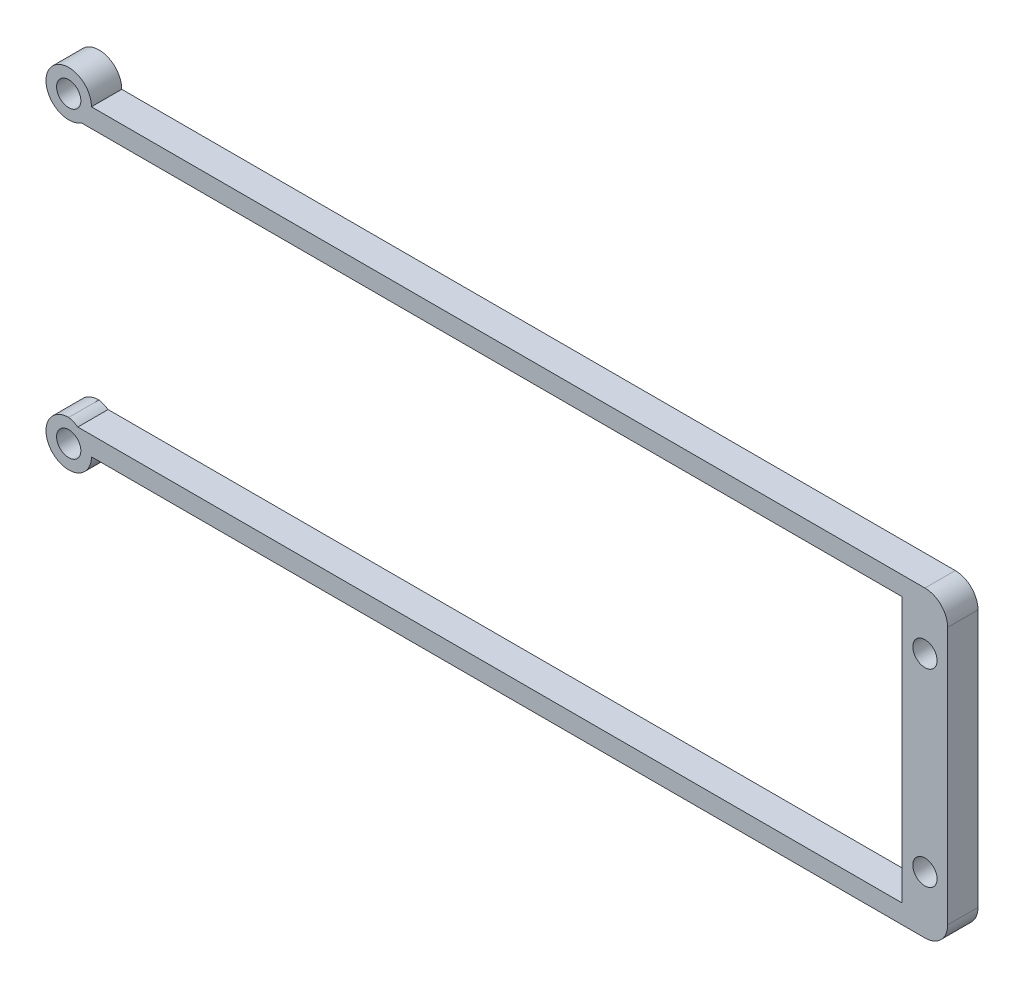
ISO-10303-21;
HEADER;
FILE_DESCRIPTION(('STEP AP214'),'2;1');
FILE_NAME('part.step','',(''),(''),'','','');
FILE_SCHEMA(('AUTOMOTIVE_DESIGN { 1 0 10303 214 1 1 1 1 }'));
ENDSEC;
DATA;
#1=APPLICATION_CONTEXT('core data for automotive mechanical design processes');
#2=APPLICATION_PROTOCOL_DEFINITION('international standard','automotive_design',2000,#1);
#3=PRODUCT_CONTEXT('',#1,'mechanical');
#4=PRODUCT('Part','Part','',(#3));
#5=PRODUCT_RELATED_PRODUCT_CATEGORY('part','',(#4));
#6=PRODUCT_DEFINITION_FORMATION('','',#4);
#7=PRODUCT_DEFINITION_CONTEXT('part definition',#1,'design');
#8=PRODUCT_DEFINITION('design','',#6,#7);
#9=PRODUCT_DEFINITION_SHAPE('','',#8);
#10=(LENGTH_UNIT() NAMED_UNIT(*) SI_UNIT(.MILLI.,.METRE.));
#11=(NAMED_UNIT(*) PLANE_ANGLE_UNIT() SI_UNIT($,.RADIAN.));
#12=(NAMED_UNIT(*) SI_UNIT($,.STERADIAN.) SOLID_ANGLE_UNIT());
#13=UNCERTAINTY_MEASURE_WITH_UNIT(LENGTH_MEASURE(1.E-05),#10,'distance_accuracy_value','');
#14=(GEOMETRIC_REPRESENTATION_CONTEXT(3) GLOBAL_UNCERTAINTY_ASSIGNED_CONTEXT((#13)) GLOBAL_UNIT_ASSIGNED_CONTEXT((#10,
#11,#12)) REPRESENTATION_CONTEXT('',''));
#15=CARTESIAN_POINT('',(0.,0.,0.));
#16=DIRECTION('',(0.,0.,1.));
#17=DIRECTION('',(1.,0.,0.));
#18=AXIS2_PLACEMENT_3D('',#15,#16,#17);
#19=CARTESIAN_POINT('',(-3.,37.,4.));
#20=DIRECTION('',(0.,0.,1.));
#21=DIRECTION('',(1.,0.,0.));
#22=AXIS2_PLACEMENT_3D('',#19,#20,#21);
#23=PLANE('',#22);
#24=DIRECTION('',(-1.,0.,0.));
#25=VECTOR('',#24,1.);
#26=CARTESIAN_POINT('',(0.,-3.,4.));
#27=LINE('',#26,#25);
#28=CARTESIAN_POINT('',(110.,-3.,4.));
#29=VERTEX_POINT('',#28);
#30=CARTESIAN_POINT('',(0.,-3.,4.));
#31=VERTEX_POINT('',#30);
#32=EDGE_CURVE('E143',#29,#31,#27,.T.);
#33=ORIENTED_EDGE('',*,*,#32,.F.);
#34=CARTESIAN_POINT('',(110.,0.,4.));
#35=DIRECTION('',(0.,0.,1.));
#36=DIRECTION('',(1.,0.,0.));
#37=AXIS2_PLACEMENT_3D('',#34,#35,#36);
#38=CIRCLE('',#37,3.);
#39=CARTESIAN_POINT('',(113.,0.,4.));
#40=VERTEX_POINT('',#39);
#41=EDGE_CURVE('E43',#29,#40,#38,.T.);
#42=ORIENTED_EDGE('',*,*,#41,.T.);
#43=DIRECTION('',(0.,1.,0.));
#44=VECTOR('',#43,1.);
#45=CARTESIAN_POINT('',(113.,0.,4.));
#46=LINE('',#45,#44);
#47=CARTESIAN_POINT('',(113.,34.,4.));
#48=VERTEX_POINT('',#47);
#49=EDGE_CURVE('E180',#40,#48,#46,.T.);
#50=ORIENTED_EDGE('',*,*,#49,.T.);
#51=CARTESIAN_POINT('',(110.,34.,4.));
#52=DIRECTION('',(0.,0.,1.));
#53=DIRECTION('',(1.,0.,0.));
#54=AXIS2_PLACEMENT_3D('',#51,#52,#53);
#55=CIRCLE('',#54,3.);
#56=CARTESIAN_POINT('',(110.,37.,4.));
#57=VERTEX_POINT('',#56);
#58=EDGE_CURVE('E50',#48,#57,#55,.T.);
#59=ORIENTED_EDGE('',*,*,#58,.T.);
#60=DIRECTION('',(1.,0.,0.));
#61=VECTOR('',#60,1.);
#62=CARTESIAN_POINT('',(0.,37.,4.));
#63=LINE('',#62,#61);
#64=CARTESIAN_POINT('',(0.,37.,4.));
#65=VERTEX_POINT('',#64);
#66=EDGE_CURVE('E133',#65,#57,#63,.T.);
#67=ORIENTED_EDGE('',*,*,#66,.F.);
#68=CARTESIAN_POINT('',(-3.,37.,4.));
#69=DIRECTION('',(0.,0.,1.));
#70=DIRECTION('',(1.,0.,0.));
#71=AXIS2_PLACEMENT_3D('',#68,#69,#70);
#72=CIRCLE('',#71,3.);
#73=CARTESIAN_POINT('',(-1.3416876048223,34.5,4.));
#74=VERTEX_POINT('',#73);
#75=EDGE_CURVE('E119',#65,#74,#72,.T.);
#76=ORIENTED_EDGE('',*,*,#75,.T.);
#77=DIRECTION('',(-1.,0.,0.));
#78=VECTOR('',#77,1.);
#79=CARTESIAN_POINT('',(52.,34.5,4.));
#80=LINE('',#79,#78);
#81=CARTESIAN_POINT('',(107.,34.5,4.));
#82=VERTEX_POINT('',#81);
#83=EDGE_CURVE('E154',#82,#74,#80,.T.);
#84=ORIENTED_EDGE('',*,*,#83,.F.);
#85=DIRECTION('',(0.,1.,0.));
#86=VECTOR('',#85,1.);
#87=CARTESIAN_POINT('',(107.,0.,4.));
#88=LINE('',#87,#86);
#89=CARTESIAN_POINT('',(107.,-0.5,4.));
#90=VERTEX_POINT('',#89);
#91=EDGE_CURVE('E158',#90,#82,#88,.T.);
#92=ORIENTED_EDGE('',*,*,#91,.F.);
#93=DIRECTION('',(1.,0.,0.));
#94=VECTOR('',#93,1.);
#95=CARTESIAN_POINT('',(52.,-0.5,4.));
#96=LINE('',#95,#94);
#97=CARTESIAN_POINT('',(-1.80104211917182,-0.5,4.));
#98=VERTEX_POINT('',#97);
#99=EDGE_CURVE('E165',#98,#90,#96,.T.);
#100=ORIENTED_EDGE('',*,*,#99,.F.);
#101=CARTESIAN_POINT('',(-3.52783349779163,-2.95320026388477,4.));
#102=DIRECTION('',(0.,0.,-1.));
#103=DIRECTION('',(-1.,0.,0.));
#104=AXIS2_PLACEMENT_3D('',#101,#102,#103);
#105=CIRCLE('',#104,3.);
#106=CARTESIAN_POINT('',(-3.,0.,4.));
#107=VERTEX_POINT('',#106);
#108=EDGE_CURVE('E149',#107,#98,#105,.T.);
#109=ORIENTED_EDGE('',*,*,#108,.F.);
#110=CARTESIAN_POINT('',(-3.,-3.,4.));
#111=DIRECTION('',(0.,0.,1.));
#112=DIRECTION('',(1.,0.,0.));
#113=AXIS2_PLACEMENT_3D('',#110,#111,#112);
#114=CIRCLE('',#113,3.);
#115=EDGE_CURVE('E128',#107,#31,#114,.T.);
#116=ORIENTED_EDGE('',*,*,#115,.T.);
#117=EDGE_LOOP('',(#33,#42,#50,#59,#67,#76,#84,#92,#100,#109,#116));
#118=FACE_BOUND('',#117,.T.);
#119=CARTESIAN_POINT('',(110.,29.5,4.));
#120=DIRECTION('',(0.,0.,1.));
#121=DIRECTION('',(1.,0.,0.));
#122=AXIS2_PLACEMENT_3D('',#119,#120,#121);
#123=CIRCLE('',#122,1.6);
#124=CARTESIAN_POINT('',(111.6,29.5,4.));
#125=VERTEX_POINT('',#124);
#126=EDGE_CURVE('E184',#125,#125,#123,.T.);
#127=ORIENTED_EDGE('',*,*,#126,.F.);
#128=EDGE_LOOP('',(#127));
#129=FACE_BOUND('',#128,.T.);
#130=CARTESIAN_POINT('',(110.,4.54369901210271,4.));
#131=DIRECTION('',(0.,0.,1.));
#132=DIRECTION('',(1.,0.,0.));
#133=AXIS2_PLACEMENT_3D('',#130,#131,#132);
#134=CIRCLE('',#133,1.60000000000001);
#135=CARTESIAN_POINT('',(111.6,4.54369901210271,4.));
#136=VERTEX_POINT('',#135);
#137=EDGE_CURVE('E183',#136,#136,#134,.T.);
#138=ORIENTED_EDGE('',*,*,#137,.F.);
#139=EDGE_LOOP('',(#138));
#140=FACE_BOUND('',#139,.T.);
#141=CARTESIAN_POINT('',(-3.,37.,4.));
#142=DIRECTION('',(0.,0.,1.));
#143=DIRECTION('',(1.,0.,0.));
#144=AXIS2_PLACEMENT_3D('',#141,#142,#143);
#145=CIRCLE('',#144,1.6);
#146=CARTESIAN_POINT('',(-1.4,37.,4.));
#147=VERTEX_POINT('',#146);
#148=EDGE_CURVE('E203',#147,#147,#145,.T.);
#149=ORIENTED_EDGE('',*,*,#148,.F.);
#150=EDGE_LOOP('',(#149));
#151=FACE_BOUND('',#150,.T.);
#152=CARTESIAN_POINT('',(-3.,-3.,4.));
#153=DIRECTION('',(0.,0.,1.));
#154=DIRECTION('',(1.,0.,0.));
#155=AXIS2_PLACEMENT_3D('',#152,#153,#154);
#156=CIRCLE('',#155,1.6);
#157=CARTESIAN_POINT('',(-1.4,-3.,4.));
#158=VERTEX_POINT('',#157);
#159=EDGE_CURVE('E197',#158,#158,#156,.T.);
#160=ORIENTED_EDGE('',*,*,#159,.F.);
#161=EDGE_LOOP('',(#160));
#162=FACE_BOUND('',#161,.T.);
#163=ADVANCED_FACE('F35',(#118,#129,#140,#151,#162),#23,.T.);
#164=CARTESIAN_POINT('',(-3.,37.,0.));
#165=DIRECTION('',(0.,0.,1.));
#166=DIRECTION('',(1.,0.,0.));
#167=AXIS2_PLACEMENT_3D('',#164,#165,#166);
#168=PLANE('',#167);
#169=DIRECTION('',(0.,-1.,0.));
#170=VECTOR('',#169,1.);
#171=CARTESIAN_POINT('',(113.,0.,0.));
#172=LINE('',#171,#170);
#173=CARTESIAN_POINT('',(113.,34.,0.));
#174=VERTEX_POINT('',#173);
#175=CARTESIAN_POINT('',(113.,0.,0.));
#176=VERTEX_POINT('',#175);
#177=EDGE_CURVE('E182',#174,#176,#172,.T.);
#178=ORIENTED_EDGE('',*,*,#177,.T.);
#179=CARTESIAN_POINT('',(110.,0.,0.));
#180=DIRECTION('',(0.,0.,1.));
#181=DIRECTION('',(1.,0.,0.));
#182=AXIS2_PLACEMENT_3D('',#179,#180,#181);
#183=CIRCLE('',#182,3.);
#184=CARTESIAN_POINT('',(110.,-3.,0.));
#185=VERTEX_POINT('',#184);
#186=EDGE_CURVE('E225',#176,#185,#183,.F.);
#187=ORIENTED_EDGE('',*,*,#186,.T.);
#188=DIRECTION('',(-1.,0.,0.));
#189=VECTOR('',#188,1.);
#190=CARTESIAN_POINT('',(-3.,-3.,0.));
#191=LINE('',#190,#189);
#192=CARTESIAN_POINT('',(0.,-3.,0.));
#193=VERTEX_POINT('',#192);
#194=EDGE_CURVE('E137',#185,#193,#191,.T.);
#195=ORIENTED_EDGE('',*,*,#194,.T.);
#196=CARTESIAN_POINT('',(-3.,-3.,0.));
#197=DIRECTION('',(0.,0.,1.));
#198=DIRECTION('',(1.,0.,0.));
#199=AXIS2_PLACEMENT_3D('',#196,#197,#198);
#200=CIRCLE('',#199,3.);
#201=CARTESIAN_POINT('',(-3.,0.,0.));
#202=VERTEX_POINT('',#201);
#203=EDGE_CURVE('E206',#202,#193,#200,.T.);
#204=ORIENTED_EDGE('',*,*,#203,.F.);
#205=CARTESIAN_POINT('',(-3.52783349779163,-2.95320026388477,0.));
#206=DIRECTION('',(0.,0.,-1.));
#207=DIRECTION('',(-1.,0.,0.));
#208=AXIS2_PLACEMENT_3D('',#205,#206,#207);
#209=CIRCLE('',#208,3.);
#210=CARTESIAN_POINT('',(-1.80104211917182,-0.5,0.));
#211=VERTEX_POINT('',#210);
#212=EDGE_CURVE('E161',#202,#211,#209,.T.);
#213=ORIENTED_EDGE('',*,*,#212,.T.);
#214=DIRECTION('',(1.,0.,0.));
#215=VECTOR('',#214,1.);
#216=CARTESIAN_POINT('',(52.,-0.5,0.));
#217=LINE('',#216,#215);
#218=CARTESIAN_POINT('',(107.,-0.5,0.));
#219=VERTEX_POINT('',#218);
#220=EDGE_CURVE('E164',#211,#219,#217,.T.);
#221=ORIENTED_EDGE('',*,*,#220,.T.);
#222=DIRECTION('',(0.,1.,0.));
#223=VECTOR('',#222,1.);
#224=CARTESIAN_POINT('',(107.,0.,0.));
#225=LINE('',#224,#223);
#226=CARTESIAN_POINT('',(107.,34.5,0.));
#227=VERTEX_POINT('',#226);
#228=EDGE_CURVE('E176',#219,#227,#225,.T.);
#229=ORIENTED_EDGE('',*,*,#228,.T.);
#230=DIRECTION('',(-1.,0.,0.));
#231=VECTOR('',#230,1.);
#232=CARTESIAN_POINT('',(52.,34.5,0.));
#233=LINE('',#232,#231);
#234=CARTESIAN_POINT('',(-1.3416876048223,34.5,0.));
#235=VERTEX_POINT('',#234);
#236=EDGE_CURVE('E150',#227,#235,#233,.T.);
#237=ORIENTED_EDGE('',*,*,#236,.T.);
#238=CARTESIAN_POINT('',(-3.,37.,0.));
#239=DIRECTION('',(0.,0.,1.));
#240=DIRECTION('',(1.,0.,0.));
#241=AXIS2_PLACEMENT_3D('',#238,#239,#240);
#242=CIRCLE('',#241,3.);
#243=CARTESIAN_POINT('',(0.,37.,0.));
#244=VERTEX_POINT('',#243);
#245=EDGE_CURVE('E210',#244,#235,#242,.T.);
#246=ORIENTED_EDGE('',*,*,#245,.F.);
#247=DIRECTION('',(1.,0.,0.));
#248=VECTOR('',#247,1.);
#249=CARTESIAN_POINT('',(-3.,37.,0.));
#250=LINE('',#249,#248);
#251=CARTESIAN_POINT('',(110.,37.,0.));
#252=VERTEX_POINT('',#251);
#253=EDGE_CURVE('E136',#244,#252,#250,.T.);
#254=ORIENTED_EDGE('',*,*,#253,.T.);
#255=CARTESIAN_POINT('',(110.,34.,0.));
#256=DIRECTION('',(0.,0.,1.));
#257=DIRECTION('',(1.,0.,0.));
#258=AXIS2_PLACEMENT_3D('',#255,#256,#257);
#259=CIRCLE('',#258,3.);
#260=EDGE_CURVE('E223',#252,#174,#259,.F.);
#261=ORIENTED_EDGE('',*,*,#260,.T.);
#262=EDGE_LOOP('',(#178,#187,#195,#204,#213,#221,#229,#237,#246,#254,#261));
#263=FACE_BOUND('',#262,.T.);
#264=CARTESIAN_POINT('',(110.,29.5,0.));
#265=DIRECTION('',(0.,0.,1.));
#266=DIRECTION('',(1.,0.,0.));
#267=AXIS2_PLACEMENT_3D('',#264,#265,#266);
#268=CIRCLE('',#267,1.6);
#269=CARTESIAN_POINT('',(111.6,29.5,0.));
#270=VERTEX_POINT('',#269);
#271=EDGE_CURVE('E178',#270,#270,#268,.F.);
#272=ORIENTED_EDGE('',*,*,#271,.F.);
#273=EDGE_LOOP('',(#272));
#274=FACE_BOUND('',#273,.T.);
#275=CARTESIAN_POINT('',(110.,4.54369901210271,0.));
#276=DIRECTION('',(0.,0.,1.));
#277=DIRECTION('',(1.,0.,0.));
#278=AXIS2_PLACEMENT_3D('',#275,#276,#277);
#279=CIRCLE('',#278,1.60000000000001);
#280=CARTESIAN_POINT('',(111.6,4.54369901210271,0.));
#281=VERTEX_POINT('',#280);
#282=EDGE_CURVE('E187',#281,#281,#279,.F.);
#283=ORIENTED_EDGE('',*,*,#282,.F.);
#284=EDGE_LOOP('',(#283));
#285=FACE_BOUND('',#284,.T.);
#286=CARTESIAN_POINT('',(-3.,37.,0.));
#287=DIRECTION('',(0.,0.,1.));
#288=DIRECTION('',(1.,0.,0.));
#289=AXIS2_PLACEMENT_3D('',#286,#287,#288);
#290=CIRCLE('',#289,1.6);
#291=CARTESIAN_POINT('',(-1.4,37.,0.));
#292=VERTEX_POINT('',#291);
#293=EDGE_CURVE('E200',#292,#292,#290,.T.);
#294=ORIENTED_EDGE('',*,*,#293,.T.);
#295=EDGE_LOOP('',(#294));
#296=FACE_BOUND('',#295,.T.);
#297=CARTESIAN_POINT('',(-3.,-3.,0.));
#298=DIRECTION('',(0.,0.,1.));
#299=DIRECTION('',(1.,0.,0.));
#300=AXIS2_PLACEMENT_3D('',#297,#298,#299);
#301=CIRCLE('',#300,1.6);
#302=CARTESIAN_POINT('',(-1.4,-3.,0.));
#303=VERTEX_POINT('',#302);
#304=EDGE_CURVE('E196',#303,#303,#301,.T.);
#305=ORIENTED_EDGE('',*,*,#304,.T.);
#306=EDGE_LOOP('',(#305));
#307=FACE_BOUND('',#306,.T.);
#308=ADVANCED_FACE('F238',(#263,#274,#285,#296,#307),#168,.F.);
#309=CARTESIAN_POINT('',(-3.,-3.,4.));
#310=DIRECTION('',(0.,0.,-1.));
#311=DIRECTION('',(-1.,0.,0.));
#312=AXIS2_PLACEMENT_3D('',#309,#310,#311);
#313=CYLINDRICAL_SURFACE('',#312,3.);
#314=ORIENTED_EDGE('',*,*,#203,.T.);
#315=DIRECTION('',(0.,0.,1.));
#316=VECTOR('',#315,1.);
#317=CARTESIAN_POINT('',(0.,-3.,-6.));
#318=LINE('',#317,#316);
#319=EDGE_CURVE('E140',#193,#31,#318,.T.);
#320=ORIENTED_EDGE('',*,*,#319,.T.);
#321=ORIENTED_EDGE('',*,*,#115,.F.);
#322=DIRECTION('',(0.,0.,-1.));
#323=VECTOR('',#322,1.);
#324=CARTESIAN_POINT('',(-3.,0.,4.));
#325=LINE('',#324,#323);
#326=EDGE_CURVE('E127',#107,#202,#325,.T.);
#327=ORIENTED_EDGE('',*,*,#326,.T.);
#328=EDGE_LOOP('',(#314,#320,#321,#327));
#329=FACE_BOUND('',#328,.T.);
#330=ADVANCED_FACE('F245',(#329),#313,.T.);
#331=CARTESIAN_POINT('',(-3.,37.,4.));
#332=DIRECTION('',(0.,0.,-1.));
#333=DIRECTION('',(-1.,0.,0.));
#334=AXIS2_PLACEMENT_3D('',#331,#332,#333);
#335=CYLINDRICAL_SURFACE('',#334,3.);
#336=ORIENTED_EDGE('',*,*,#245,.T.);
#337=DIRECTION('',(0.,0.,1.));
#338=VECTOR('',#337,1.);
#339=CARTESIAN_POINT('',(-1.3416876048223,34.5,0.));
#340=LINE('',#339,#338);
#341=EDGE_CURVE('E124',#235,#74,#340,.T.);
#342=ORIENTED_EDGE('',*,*,#341,.T.);
#343=ORIENTED_EDGE('',*,*,#75,.F.);
#344=DIRECTION('',(0.,0.,1.));
#345=VECTOR('',#344,1.);
#346=CARTESIAN_POINT('',(0.,37.,-6.));
#347=LINE('',#346,#345);
#348=EDGE_CURVE('E122',#244,#65,#347,.T.);
#349=ORIENTED_EDGE('',*,*,#348,.F.);
#350=EDGE_LOOP('',(#336,#342,#343,#349));
#351=FACE_BOUND('',#350,.T.);
#352=ADVANCED_FACE('F121',(#351),#335,.T.);
#353=CARTESIAN_POINT('',(-3.,37.,4.));
#354=DIRECTION('',(0.,0.,-1.));
#355=DIRECTION('',(-1.,0.,0.));
#356=AXIS2_PLACEMENT_3D('',#353,#354,#355);
#357=CYLINDRICAL_SURFACE('',#356,1.6);
#358=ORIENTED_EDGE('',*,*,#148,.T.);
#359=EDGE_LOOP('',(#358));
#360=FACE_BOUND('',#359,.T.);
#361=ORIENTED_EDGE('',*,*,#293,.F.);
#362=EDGE_LOOP('',(#361));
#363=FACE_BOUND('',#362,.T.);
#364=ADVANCED_FACE('F277',(#360,#363),#357,.F.);
#365=CARTESIAN_POINT('',(-3.,-3.,4.));
#366=DIRECTION('',(0.,0.,-1.));
#367=DIRECTION('',(-1.,0.,0.));
#368=AXIS2_PLACEMENT_3D('',#365,#366,#367);
#369=CYLINDRICAL_SURFACE('',#368,1.6);
#370=ORIENTED_EDGE('',*,*,#159,.T.);
#371=EDGE_LOOP('',(#370));
#372=FACE_BOUND('',#371,.T.);
#373=ORIENTED_EDGE('',*,*,#304,.F.);
#374=EDGE_LOOP('',(#373));
#375=FACE_BOUND('',#374,.T.);
#376=ADVANCED_FACE('F356',(#372,#375),#369,.F.);
#377=CARTESIAN_POINT('',(110.,29.5,-127.581346598944));
#378=DIRECTION('',(0.,0.,1.));
#379=DIRECTION('',(1.,0.,0.));
#380=AXIS2_PLACEMENT_3D('',#377,#378,#379);
#381=CYLINDRICAL_SURFACE('',#380,1.6);
#382=ORIENTED_EDGE('',*,*,#126,.T.);
#383=EDGE_LOOP('',(#382));
#384=FACE_BOUND('',#383,.T.);
#385=ORIENTED_EDGE('',*,*,#271,.T.);
#386=EDGE_LOOP('',(#385));
#387=FACE_BOUND('',#386,.T.);
#388=ADVANCED_FACE('F344',(#384,#387),#381,.F.);
#389=CARTESIAN_POINT('',(110.,4.54369901210271,-127.581346598944));
#390=DIRECTION('',(0.,0.,1.));
#391=DIRECTION('',(1.,0.,0.));
#392=AXIS2_PLACEMENT_3D('',#389,#390,#391);
#393=CYLINDRICAL_SURFACE('',#392,1.60000000000001);
#394=ORIENTED_EDGE('',*,*,#137,.T.);
#395=EDGE_LOOP('',(#394));
#396=FACE_BOUND('',#395,.T.);
#397=ORIENTED_EDGE('',*,*,#282,.T.);
#398=EDGE_LOOP('',(#397));
#399=FACE_BOUND('',#398,.T.);
#400=ADVANCED_FACE('F339',(#396,#399),#393,.F.);
#401=CARTESIAN_POINT('',(113.,0.,-127.581346598944));
#402=DIRECTION('',(1.,0.,0.));
#403=DIRECTION('',(0.,0.,-1.));
#404=AXIS2_PLACEMENT_3D('',#401,#402,#403);
#405=PLANE('',#404);
#406=ORIENTED_EDGE('',*,*,#49,.F.);
#407=DIRECTION('',(0.,0.,-1.));
#408=VECTOR('',#407,1.);
#409=CARTESIAN_POINT('',(113.,0.,0.));
#410=LINE('',#409,#408);
#411=EDGE_CURVE('E220',#40,#176,#410,.T.);
#412=ORIENTED_EDGE('',*,*,#411,.T.);
#413=ORIENTED_EDGE('',*,*,#177,.F.);
#414=DIRECTION('',(0.,0.,1.));
#415=VECTOR('',#414,1.);
#416=CARTESIAN_POINT('',(113.,34.,4.));
#417=LINE('',#416,#415);
#418=EDGE_CURVE('E217',#174,#48,#417,.T.);
#419=ORIENTED_EDGE('',*,*,#418,.T.);
#420=EDGE_LOOP('',(#406,#412,#413,#419));
#421=FACE_BOUND('',#420,.T.);
#422=ADVANCED_FACE('F233',(#421),#405,.T.);
#423=CARTESIAN_POINT('',(107.,0.,0.));
#424=DIRECTION('',(1.,0.,0.));
#425=DIRECTION('',(0.,0.,-1.));
#426=AXIS2_PLACEMENT_3D('',#423,#424,#425);
#427=PLANE('',#426);
#428=ORIENTED_EDGE('',*,*,#91,.T.);
#429=DIRECTION('',(0.,0.,1.));
#430=VECTOR('',#429,1.);
#431=CARTESIAN_POINT('',(107.,34.5,0.));
#432=LINE('',#431,#430);
#433=EDGE_CURVE('E153',#227,#82,#432,.T.);
#434=ORIENTED_EDGE('',*,*,#433,.F.);
#435=ORIENTED_EDGE('',*,*,#228,.F.);
#436=DIRECTION('',(0.,0.,1.));
#437=VECTOR('',#436,1.);
#438=CARTESIAN_POINT('',(107.,-0.5,0.));
#439=LINE('',#438,#437);
#440=EDGE_CURVE('E156',#219,#90,#439,.T.);
#441=ORIENTED_EDGE('',*,*,#440,.T.);
#442=EDGE_LOOP('',(#428,#434,#435,#441));
#443=FACE_BOUND('',#442,.T.);
#444=ADVANCED_FACE('F255',(#443),#427,.F.);
#445=CARTESIAN_POINT('',(-3.52783349779163,-2.95320026388477,0.));
#446=DIRECTION('',(0.,0.,1.));
#447=DIRECTION('',(1.,0.,0.));
#448=AXIS2_PLACEMENT_3D('',#445,#446,#447);
#449=CYLINDRICAL_SURFACE('',#448,3.);
#450=ORIENTED_EDGE('',*,*,#108,.T.);
#451=DIRECTION('',(0.,0.,1.));
#452=VECTOR('',#451,1.);
#453=CARTESIAN_POINT('',(-1.80104211917182,-0.5,0.));
#454=LINE('',#453,#452);
#455=EDGE_CURVE('E168',#211,#98,#454,.T.);
#456=ORIENTED_EDGE('',*,*,#455,.F.);
#457=ORIENTED_EDGE('',*,*,#212,.F.);
#458=ORIENTED_EDGE('',*,*,#326,.F.);
#459=EDGE_LOOP('',(#450,#456,#457,#458));
#460=FACE_BOUND('',#459,.T.);
#461=ADVANCED_FACE('F248',(#460),#449,.T.);
#462=CARTESIAN_POINT('',(52.,-0.5,0.));
#463=DIRECTION('',(0.,-1.,0.));
#464=DIRECTION('',(0.,0.,-1.));
#465=AXIS2_PLACEMENT_3D('',#462,#463,#464);
#466=PLANE('',#465);
#467=ORIENTED_EDGE('',*,*,#99,.T.);
#468=ORIENTED_EDGE('',*,*,#440,.F.);
#469=ORIENTED_EDGE('',*,*,#220,.F.);
#470=ORIENTED_EDGE('',*,*,#455,.T.);
#471=EDGE_LOOP('',(#467,#468,#469,#470));
#472=FACE_BOUND('',#471,.T.);
#473=ADVANCED_FACE('F253',(#472),#466,.F.);
#474=CARTESIAN_POINT('',(52.,34.5,0.));
#475=DIRECTION('',(0.,1.,0.));
#476=DIRECTION('',(0.,0.,1.));
#477=AXIS2_PLACEMENT_3D('',#474,#475,#476);
#478=PLANE('',#477);
#479=ORIENTED_EDGE('',*,*,#83,.T.);
#480=ORIENTED_EDGE('',*,*,#341,.F.);
#481=ORIENTED_EDGE('',*,*,#236,.F.);
#482=ORIENTED_EDGE('',*,*,#433,.T.);
#483=EDGE_LOOP('',(#479,#480,#481,#482));
#484=FACE_BOUND('',#483,.T.);
#485=ADVANCED_FACE('F259',(#484),#478,.F.);
#486=CARTESIAN_POINT('',(0.,-3.,-6.));
#487=DIRECTION('',(0.,1.,0.));
#488=DIRECTION('',(-1.,0.,0.));
#489=AXIS2_PLACEMENT_3D('',#486,#487,#488);
#490=PLANE('',#489);
#491=ORIENTED_EDGE('',*,*,#194,.F.);
#492=DIRECTION('',(0.,0.,-1.));
#493=VECTOR('',#492,1.);
#494=CARTESIAN_POINT('',(110.,-3.,4.));
#495=LINE('',#494,#493);
#496=EDGE_CURVE('E58',#185,#29,#495,.F.);
#497=ORIENTED_EDGE('',*,*,#496,.T.);
#498=ORIENTED_EDGE('',*,*,#32,.T.);
#499=ORIENTED_EDGE('',*,*,#319,.F.);
#500=EDGE_LOOP('',(#491,#497,#498,#499));
#501=FACE_BOUND('',#500,.T.);
#502=ADVANCED_FACE('F242',(#501),#490,.F.);
#503=CARTESIAN_POINT('',(0.,37.,-6.));
#504=DIRECTION('',(0.,-1.,0.));
#505=DIRECTION('',(0.,0.,-1.));
#506=AXIS2_PLACEMENT_3D('',#503,#504,#505);
#507=PLANE('',#506);
#508=ORIENTED_EDGE('',*,*,#66,.T.);
#509=DIRECTION('',(0.,0.,1.));
#510=VECTOR('',#509,1.);
#511=CARTESIAN_POINT('',(110.,37.,0.));
#512=LINE('',#511,#510);
#513=EDGE_CURVE('E11',#57,#252,#512,.F.);
#514=ORIENTED_EDGE('',*,*,#513,.T.);
#515=ORIENTED_EDGE('',*,*,#253,.F.);
#516=ORIENTED_EDGE('',*,*,#348,.T.);
#517=EDGE_LOOP('',(#508,#514,#515,#516));
#518=FACE_BOUND('',#517,.T.);
#519=ADVANCED_FACE('F132',(#518),#507,.F.);
#520=CARTESIAN_POINT('',(110.,0.,-127.581346598944));
#521=DIRECTION('',(0.,0.,1.));
#522=DIRECTION('',(1.,0.,0.));
#523=AXIS2_PLACEMENT_3D('',#520,#521,#522);
#524=CYLINDRICAL_SURFACE('',#523,3.);
#525=ORIENTED_EDGE('',*,*,#41,.F.);
#526=ORIENTED_EDGE('',*,*,#496,.F.);
#527=ORIENTED_EDGE('',*,*,#186,.F.);
#528=ORIENTED_EDGE('',*,*,#411,.F.);
#529=EDGE_LOOP('',(#525,#526,#527,#528));
#530=FACE_BOUND('',#529,.T.);
#531=ADVANCED_FACE('F236',(#530),#524,.T.);
#532=CARTESIAN_POINT('',(110.,34.,-127.581346598944));
#533=DIRECTION('',(0.,0.,-1.));
#534=DIRECTION('',(-1.,0.,0.));
#535=AXIS2_PLACEMENT_3D('',#532,#533,#534);
#536=CYLINDRICAL_SURFACE('',#535,3.);
#537=ORIENTED_EDGE('',*,*,#260,.F.);
#538=ORIENTED_EDGE('',*,*,#513,.F.);
#539=ORIENTED_EDGE('',*,*,#58,.F.);
#540=ORIENTED_EDGE('',*,*,#418,.F.);
#541=EDGE_LOOP('',(#537,#538,#539,#540));
#542=FACE_BOUND('',#541,.T.);
#543=ADVANCED_FACE('F37',(#542),#536,.T.);
#544=CLOSED_SHELL('',(#163,#308,#330,#352,#364,#376,#388,#400,#422,#444,#461,#473,#485,#502,
#519,#531,#543));
#545=MANIFOLD_SOLID_BREP('B2',#544);
#546=ADVANCED_BREP_SHAPE_REPRESENTATION('',(#18,#545),#14);
#547=SHAPE_DEFINITION_REPRESENTATION(#9,#546);
ENDSEC;
END-ISO-10303-21;
